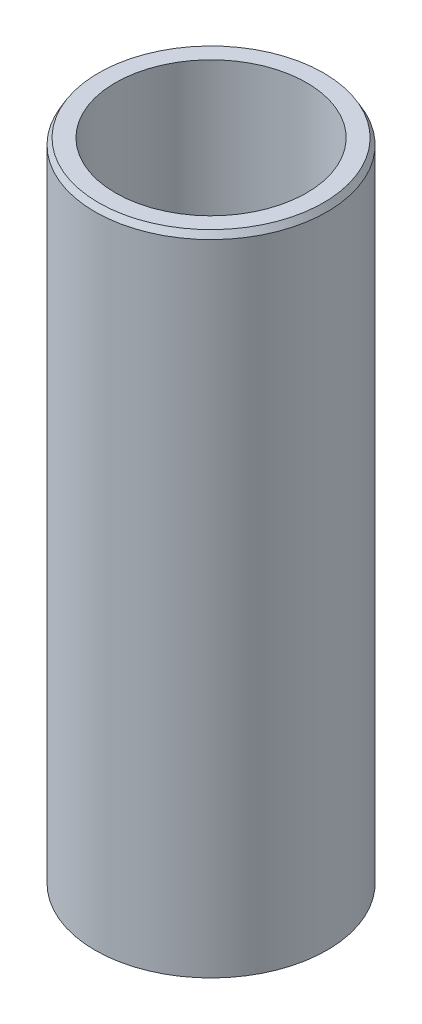
ISO-10303-21;
HEADER;
FILE_DESCRIPTION(('STEP AP214'),'2;1');
FILE_NAME('part.step','',(''),(''),'','','');
FILE_SCHEMA(('AUTOMOTIVE_DESIGN { 1 0 10303 214 1 1 1 1 }'));
ENDSEC;
DATA;
#1=APPLICATION_CONTEXT('core data for automotive mechanical design processes');
#2=APPLICATION_PROTOCOL_DEFINITION('international standard','automotive_design',2000,#1);
#3=PRODUCT_CONTEXT('',#1,'mechanical');
#4=PRODUCT('Part','Part','',(#3));
#5=PRODUCT_RELATED_PRODUCT_CATEGORY('part','',(#4));
#6=PRODUCT_DEFINITION_FORMATION('','',#4);
#7=PRODUCT_DEFINITION_CONTEXT('part definition',#1,'design');
#8=PRODUCT_DEFINITION('design','',#6,#7);
#9=PRODUCT_DEFINITION_SHAPE('','',#8);
#10=(LENGTH_UNIT() NAMED_UNIT(*) SI_UNIT(.MILLI.,.METRE.));
#11=(NAMED_UNIT(*) PLANE_ANGLE_UNIT() SI_UNIT($,.RADIAN.));
#12=(NAMED_UNIT(*) SI_UNIT($,.STERADIAN.) SOLID_ANGLE_UNIT());
#13=UNCERTAINTY_MEASURE_WITH_UNIT(LENGTH_MEASURE(1.E-05),#10,'distance_accuracy_value','');
#14=(GEOMETRIC_REPRESENTATION_CONTEXT(3) GLOBAL_UNCERTAINTY_ASSIGNED_CONTEXT((#13)) GLOBAL_UNIT_ASSIGNED_CONTEXT((#10,
#11,#12)) REPRESENTATION_CONTEXT('',''));
#15=CARTESIAN_POINT('',(0.,0.,0.));
#16=DIRECTION('',(0.,0.,1.));
#17=DIRECTION('',(1.,0.,0.));
#18=AXIS2_PLACEMENT_3D('',#15,#16,#17);
#19=CARTESIAN_POINT('',(0.,293.749740810403,0.));
#20=DIRECTION('',(0.,-1.,0.));
#21=DIRECTION('',(0.,0.,-1.));
#22=AXIS2_PLACEMENT_3D('',#19,#20,#21);
#23=CYLINDRICAL_SURFACE('',#22,52.5);
#24=CARTESIAN_POINT('',(0.,290.973941342843,0.));
#25=DIRECTION('',(0.,1.,0.));
#26=DIRECTION('',(0.,0.,1.));
#27=AXIS2_PLACEMENT_3D('',#24,#25,#26);
#28=CIRCLE('',#27,52.5);
#29=CARTESIAN_POINT('',(0.,290.973941342843,52.5));
#30=VERTEX_POINT('',#29);
#31=EDGE_CURVE('E50',#30,#30,#28,.F.);
#32=ORIENTED_EDGE('',*,*,#31,.T.);
#33=EDGE_LOOP('',(#32));
#34=FACE_BOUND('',#33,.T.);
#35=CARTESIAN_POINT('',(0.,1.60260856981204,0.));
#36=DIRECTION('',(0.,1.,0.));
#37=DIRECTION('',(0.,0.,1.));
#38=AXIS2_PLACEMENT_3D('',#35,#36,#37);
#39=CIRCLE('',#38,52.5);
#40=CARTESIAN_POINT('',(0.,1.60260856981204,52.5));
#41=VERTEX_POINT('',#40);
#42=EDGE_CURVE('E51',#41,#41,#39,.T.);
#43=ORIENTED_EDGE('',*,*,#42,.T.);
#44=EDGE_LOOP('',(#43));
#45=FACE_BOUND('',#44,.T.);
#46=ADVANCED_FACE('F39',(#34,#45),#23,.T.);
#47=CARTESIAN_POINT('',(0.,293.749740810403,0.));
#48=DIRECTION('',(0.,1.,0.));
#49=DIRECTION('',(0.,0.,1.));
#50=AXIS2_PLACEMENT_3D('',#47,#48,#49);
#51=PLANE('',#50);
#52=CARTESIAN_POINT('',(0.,293.749740810403,0.));
#53=DIRECTION('',(0.,1.,0.));
#54=DIRECTION('',(0.,0.,1.));
#55=AXIS2_PLACEMENT_3D('',#52,#53,#54);
#56=CIRCLE('',#55,50.8973914301879);
#57=CARTESIAN_POINT('',(0.,293.749740810403,50.8973914301879));
#58=VERTEX_POINT('',#57);
#59=EDGE_CURVE('E54',#58,#58,#56,.T.);
#60=ORIENTED_EDGE('',*,*,#59,.T.);
#61=EDGE_LOOP('',(#60));
#62=FACE_BOUND('',#61,.T.);
#63=CARTESIAN_POINT('',(0.,293.749740810403,0.));
#64=DIRECTION('',(0.,1.,0.));
#65=DIRECTION('',(0.,0.,1.));
#66=AXIS2_PLACEMENT_3D('',#63,#64,#65);
#67=CIRCLE('',#66,43.2450359523701);
#68=CARTESIAN_POINT('',(0.,293.749740810403,43.2450359523701));
#69=VERTEX_POINT('',#68);
#70=EDGE_CURVE('E58',#69,#69,#67,.T.);
#71=ORIENTED_EDGE('',*,*,#70,.F.);
#72=EDGE_LOOP('',(#71));
#73=FACE_BOUND('',#72,.T.);
#74=ADVANCED_FACE('F69',(#62,#73),#51,.T.);
#75=CARTESIAN_POINT('',(0.,0.,0.));
#76=DIRECTION('',(0.,1.,0.));
#77=DIRECTION('',(0.,0.,1.));
#78=AXIS2_PLACEMENT_3D('',#75,#76,#77);
#79=PLANE('',#78);
#80=CARTESIAN_POINT('',(0.,0.,0.));
#81=DIRECTION('',(0.,1.,0.));
#82=DIRECTION('',(0.,0.,1.));
#83=AXIS2_PLACEMENT_3D('',#80,#81,#82);
#84=CIRCLE('',#83,49.7242005324402);
#85=CARTESIAN_POINT('',(0.,0.,49.7242005324402));
#86=VERTEX_POINT('',#85);
#87=EDGE_CURVE('E10',#86,#86,#84,.F.);
#88=ORIENTED_EDGE('',*,*,#87,.T.);
#89=EDGE_LOOP('',(#88));
#90=FACE_BOUND('',#89,.T.);
#91=CARTESIAN_POINT('',(0.,0.,0.));
#92=DIRECTION('',(0.,1.,0.));
#93=DIRECTION('',(0.,0.,1.));
#94=AXIS2_PLACEMENT_3D('',#91,#92,#93);
#95=CIRCLE('',#94,43.2450359523701);
#96=CARTESIAN_POINT('',(0.,0.,43.2450359523701));
#97=VERTEX_POINT('',#96);
#98=EDGE_CURVE('E63',#97,#97,#95,.T.);
#99=ORIENTED_EDGE('',*,*,#98,.T.);
#100=EDGE_LOOP('',(#99));
#101=FACE_BOUND('',#100,.T.);
#102=ADVANCED_FACE('F75',(#90,#101),#79,.F.);
#103=CARTESIAN_POINT('',(0.,293.749740810403,0.));
#104=DIRECTION('',(0.,-1.,0.));
#105=DIRECTION('',(0.,0.,-1.));
#106=AXIS2_PLACEMENT_3D('',#103,#104,#105);
#107=CYLINDRICAL_SURFACE('',#106,43.2450359523701);
#108=ORIENTED_EDGE('',*,*,#70,.T.);
#109=EDGE_LOOP('',(#108));
#110=FACE_BOUND('',#109,.T.);
#111=ORIENTED_EDGE('',*,*,#98,.F.);
#112=EDGE_LOOP('',(#111));
#113=FACE_BOUND('',#112,.T.);
#114=ADVANCED_FACE('F70',(#110,#113),#107,.F.);
#115=CARTESIAN_POINT('',(0.,293.749740810403,0.));
#116=DIRECTION('',(0.,-1.,0.));
#117=DIRECTION('',(0.,0.,-1.));
#118=AXIS2_PLACEMENT_3D('',#115,#116,#117);
#119=CONICAL_SURFACE('',#118,50.8973914301879,0.523598775598289);
#120=ORIENTED_EDGE('',*,*,#31,.F.);
#121=EDGE_LOOP('',(#120));
#122=FACE_BOUND('',#121,.T.);
#123=ORIENTED_EDGE('',*,*,#59,.F.);
#124=EDGE_LOOP('',(#123));
#125=FACE_BOUND('',#124,.T.);
#126=ADVANCED_FACE('F81',(#122,#125),#119,.T.);
#127=CARTESIAN_POINT('',(0.,1.60260856981204,0.));
#128=DIRECTION('',(0.,1.,0.));
#129=DIRECTION('',(0.,0.,1.));
#130=AXIS2_PLACEMENT_3D('',#127,#128,#129);
#131=CONICAL_SURFACE('',#130,52.5,1.04719755119661);
#132=ORIENTED_EDGE('',*,*,#87,.F.);
#133=EDGE_LOOP('',(#132));
#134=FACE_BOUND('',#133,.T.);
#135=ORIENTED_EDGE('',*,*,#42,.F.);
#136=EDGE_LOOP('',(#135));
#137=FACE_BOUND('',#136,.T.);
#138=ADVANCED_FACE('F45',(#134,#137),#131,.T.);
#139=CLOSED_SHELL('',(#46,#74,#102,#114,#126,#138));
#140=MANIFOLD_SOLID_BREP('B2',#139);
#141=ADVANCED_BREP_SHAPE_REPRESENTATION('',(#18,#140),#14);
#142=SHAPE_DEFINITION_REPRESENTATION(#9,#141);
ENDSEC;
END-ISO-10303-21;
